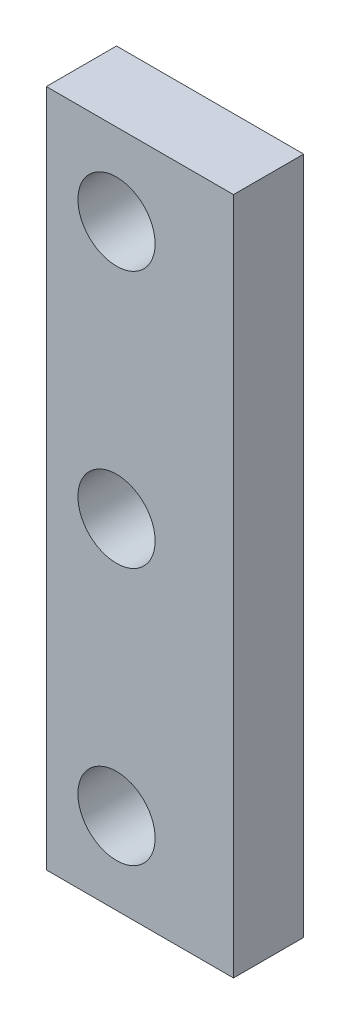
ISO-10303-21;
HEADER;
FILE_DESCRIPTION(('STEP AP214'),'2;1');
FILE_NAME('part.step','',(''),(''),'','','');
FILE_SCHEMA(('AUTOMOTIVE_DESIGN { 1 0 10303 214 1 1 1 1 }'));
ENDSEC;
DATA;
#1=APPLICATION_CONTEXT('core data for automotive mechanical design processes');
#2=APPLICATION_PROTOCOL_DEFINITION('international standard','automotive_design',2000,#1);
#3=PRODUCT_CONTEXT('',#1,'mechanical');
#4=PRODUCT('Part','Part','',(#3));
#5=PRODUCT_RELATED_PRODUCT_CATEGORY('part','',(#4));
#6=PRODUCT_DEFINITION_FORMATION('','',#4);
#7=PRODUCT_DEFINITION_CONTEXT('part definition',#1,'design');
#8=PRODUCT_DEFINITION('design','',#6,#7);
#9=PRODUCT_DEFINITION_SHAPE('','',#8);
#10=(LENGTH_UNIT() NAMED_UNIT(*) SI_UNIT(.MILLI.,.METRE.));
#11=(NAMED_UNIT(*) PLANE_ANGLE_UNIT() SI_UNIT($,.RADIAN.));
#12=(NAMED_UNIT(*) SI_UNIT($,.STERADIAN.) SOLID_ANGLE_UNIT());
#13=UNCERTAINTY_MEASURE_WITH_UNIT(LENGTH_MEASURE(1.E-05),#10,'distance_accuracy_value','');
#14=(GEOMETRIC_REPRESENTATION_CONTEXT(3) GLOBAL_UNCERTAINTY_ASSIGNED_CONTEXT((#13)) GLOBAL_UNIT_ASSIGNED_CONTEXT((#10,
#11,#12)) REPRESENTATION_CONTEXT('',''));
#15=CARTESIAN_POINT('',(0.,0.,0.));
#16=DIRECTION('',(0.,0.,1.));
#17=DIRECTION('',(1.,0.,0.));
#18=AXIS2_PLACEMENT_3D('',#15,#16,#17);
#19=CARTESIAN_POINT('',(0.,0.,3.));
#20=DIRECTION('',(0.,0.,1.));
#21=DIRECTION('',(1.,0.,0.));
#22=AXIS2_PLACEMENT_3D('',#19,#20,#21);
#23=PLANE('',#22);
#24=CARTESIAN_POINT('',(3.,0.,3.));
#25=DIRECTION('',(0.,0.,1.));
#26=DIRECTION('',(1.,0.,0.));
#27=AXIS2_PLACEMENT_3D('',#24,#25,#26);
#28=CIRCLE('',#27,1.65);
#29=CARTESIAN_POINT('',(4.65,0.,3.));
#30=VERTEX_POINT('',#29);
#31=EDGE_CURVE('E114',#30,#30,#28,.T.);
#32=ORIENTED_EDGE('',*,*,#31,.F.);
#33=EDGE_LOOP('',(#32));
#34=FACE_BOUND('',#33,.T.);
#35=DIRECTION('',(0.,1.,0.));
#36=VECTOR('',#35,1.);
#37=CARTESIAN_POINT('',(8.,14.5,3.));
#38=LINE('',#37,#36);
#39=CARTESIAN_POINT('',(8.,-14.5,3.));
#40=VERTEX_POINT('',#39);
#41=CARTESIAN_POINT('',(8.,14.5,3.));
#42=VERTEX_POINT('',#41);
#43=EDGE_CURVE('E84',#40,#42,#38,.T.);
#44=ORIENTED_EDGE('',*,*,#43,.T.);
#45=DIRECTION('',(-1.,0.,0.));
#46=VECTOR('',#45,1.);
#47=CARTESIAN_POINT('',(0.,14.5,3.));
#48=LINE('',#47,#46);
#49=CARTESIAN_POINT('',(0.,14.5,3.));
#50=VERTEX_POINT('',#49);
#51=EDGE_CURVE('E79',#42,#50,#48,.T.);
#52=ORIENTED_EDGE('',*,*,#51,.T.);
#53=DIRECTION('',(0.,-1.,0.));
#54=VECTOR('',#53,1.);
#55=CARTESIAN_POINT('',(0.,14.5,3.));
#56=LINE('',#55,#54);
#57=CARTESIAN_POINT('',(0.,-14.5,3.));
#58=VERTEX_POINT('',#57);
#59=EDGE_CURVE('E82',#50,#58,#56,.T.);
#60=ORIENTED_EDGE('',*,*,#59,.T.);
#61=DIRECTION('',(1.,0.,0.));
#62=VECTOR('',#61,1.);
#63=CARTESIAN_POINT('',(0.,-14.5,3.));
#64=LINE('',#63,#62);
#65=EDGE_CURVE('E49',#58,#40,#64,.T.);
#66=ORIENTED_EDGE('',*,*,#65,.T.);
#67=EDGE_LOOP('',(#44,#52,#60,#66));
#68=FACE_BOUND('',#67,.T.);
#69=CARTESIAN_POINT('',(3.,11.,3.));
#70=DIRECTION('',(0.,0.,1.));
#71=DIRECTION('',(1.,0.,0.));
#72=AXIS2_PLACEMENT_3D('',#69,#70,#71);
#73=CIRCLE('',#72,1.65);
#74=CARTESIAN_POINT('',(4.65,11.,3.));
#75=VERTEX_POINT('',#74);
#76=EDGE_CURVE('E99',#75,#75,#73,.T.);
#77=ORIENTED_EDGE('',*,*,#76,.F.);
#78=EDGE_LOOP('',(#77));
#79=FACE_BOUND('',#78,.T.);
#80=CARTESIAN_POINT('',(3.,-11.,3.));
#81=DIRECTION('',(0.,0.,1.));
#82=DIRECTION('',(-1.,0.,0.));
#83=AXIS2_PLACEMENT_3D('',#80,#81,#82);
#84=CIRCLE('',#83,1.65);
#85=CARTESIAN_POINT('',(1.35,-11.,3.));
#86=VERTEX_POINT('',#85);
#87=EDGE_CURVE('E120',#86,#86,#84,.T.);
#88=ORIENTED_EDGE('',*,*,#87,.F.);
#89=EDGE_LOOP('',(#88));
#90=FACE_BOUND('',#89,.T.);
#91=ADVANCED_FACE('F32',(#34,#68,#79,#90),#23,.T.);
#92=CARTESIAN_POINT('',(0.,0.,0.));
#93=DIRECTION('',(0.,0.,1.));
#94=DIRECTION('',(1.,0.,0.));
#95=AXIS2_PLACEMENT_3D('',#92,#93,#94);
#96=PLANE('',#95);
#97=DIRECTION('',(0.,1.,0.));
#98=VECTOR('',#97,1.);
#99=CARTESIAN_POINT('',(8.,14.5,0.));
#100=LINE('',#99,#98);
#101=CARTESIAN_POINT('',(8.,-14.5,0.));
#102=VERTEX_POINT('',#101);
#103=CARTESIAN_POINT('',(8.,14.5,0.));
#104=VERTEX_POINT('',#103);
#105=EDGE_CURVE('E96',#102,#104,#100,.T.);
#106=ORIENTED_EDGE('',*,*,#105,.F.);
#107=DIRECTION('',(1.,0.,0.));
#108=VECTOR('',#107,1.);
#109=CARTESIAN_POINT('',(0.,-14.5,0.));
#110=LINE('',#109,#108);
#111=CARTESIAN_POINT('',(0.,-14.5,0.));
#112=VERTEX_POINT('',#111);
#113=EDGE_CURVE('E72',#112,#102,#110,.T.);
#114=ORIENTED_EDGE('',*,*,#113,.F.);
#115=DIRECTION('',(0.,-1.,0.));
#116=VECTOR('',#115,1.);
#117=CARTESIAN_POINT('',(0.,14.5,0.));
#118=LINE('',#117,#116);
#119=CARTESIAN_POINT('',(0.,14.5,0.));
#120=VERTEX_POINT('',#119);
#121=EDGE_CURVE('E66',#120,#112,#118,.T.);
#122=ORIENTED_EDGE('',*,*,#121,.F.);
#123=DIRECTION('',(-1.,0.,0.));
#124=VECTOR('',#123,1.);
#125=CARTESIAN_POINT('',(0.,14.5,0.));
#126=LINE('',#125,#124);
#127=EDGE_CURVE('E88',#104,#120,#126,.T.);
#128=ORIENTED_EDGE('',*,*,#127,.F.);
#129=EDGE_LOOP('',(#106,#114,#122,#128));
#130=FACE_BOUND('',#129,.T.);
#131=CARTESIAN_POINT('',(3.,11.,0.));
#132=DIRECTION('',(0.,0.,1.));
#133=DIRECTION('',(1.,0.,0.));
#134=AXIS2_PLACEMENT_3D('',#131,#132,#133);
#135=CIRCLE('',#134,1.65);
#136=CARTESIAN_POINT('',(4.65,11.,0.));
#137=VERTEX_POINT('',#136);
#138=EDGE_CURVE('E111',#137,#137,#135,.T.);
#139=ORIENTED_EDGE('',*,*,#138,.T.);
#140=EDGE_LOOP('',(#139));
#141=FACE_BOUND('',#140,.T.);
#142=CARTESIAN_POINT('',(3.,0.,0.));
#143=DIRECTION('',(0.,0.,1.));
#144=DIRECTION('',(1.,0.,0.));
#145=AXIS2_PLACEMENT_3D('',#142,#143,#144);
#146=CIRCLE('',#145,1.65);
#147=CARTESIAN_POINT('',(4.65,0.,0.));
#148=VERTEX_POINT('',#147);
#149=EDGE_CURVE('E117',#148,#148,#146,.T.);
#150=ORIENTED_EDGE('',*,*,#149,.T.);
#151=EDGE_LOOP('',(#150));
#152=FACE_BOUND('',#151,.T.);
#153=CARTESIAN_POINT('',(3.,-11.,0.));
#154=DIRECTION('',(0.,0.,1.));
#155=DIRECTION('',(-1.,0.,0.));
#156=AXIS2_PLACEMENT_3D('',#153,#154,#155);
#157=CIRCLE('',#156,1.65);
#158=CARTESIAN_POINT('',(1.35,-11.,0.));
#159=VERTEX_POINT('',#158);
#160=EDGE_CURVE('E123',#159,#159,#157,.T.);
#161=ORIENTED_EDGE('',*,*,#160,.T.);
#162=EDGE_LOOP('',(#161));
#163=FACE_BOUND('',#162,.T.);
#164=ADVANCED_FACE('F107',(#130,#141,#152,#163),#96,.F.);
#165=CARTESIAN_POINT('',(8.,14.5,3.));
#166=DIRECTION('',(-1.,0.,0.));
#167=DIRECTION('',(0.,0.,1.));
#168=AXIS2_PLACEMENT_3D('',#165,#166,#167);
#169=PLANE('',#168);
#170=ORIENTED_EDGE('',*,*,#105,.T.);
#171=DIRECTION('',(0.,0.,-1.));
#172=VECTOR('',#171,1.);
#173=CARTESIAN_POINT('',(8.,14.5,3.));
#174=LINE('',#173,#172);
#175=EDGE_CURVE('E11',#42,#104,#174,.T.);
#176=ORIENTED_EDGE('',*,*,#175,.F.);
#177=ORIENTED_EDGE('',*,*,#43,.F.);
#178=DIRECTION('',(0.,0.,-1.));
#179=VECTOR('',#178,1.);
#180=CARTESIAN_POINT('',(8.,-14.5,3.));
#181=LINE('',#180,#179);
#182=EDGE_CURVE('E92',#40,#102,#181,.T.);
#183=ORIENTED_EDGE('',*,*,#182,.T.);
#184=EDGE_LOOP('',(#170,#176,#177,#183));
#185=FACE_BOUND('',#184,.T.);
#186=ADVANCED_FACE('F34',(#185),#169,.F.);
#187=CARTESIAN_POINT('',(0.,14.5,3.));
#188=DIRECTION('',(0.,-1.,0.));
#189=DIRECTION('',(0.,0.,-1.));
#190=AXIS2_PLACEMENT_3D('',#187,#188,#189);
#191=PLANE('',#190);
#192=ORIENTED_EDGE('',*,*,#127,.T.);
#193=DIRECTION('',(0.,0.,-1.));
#194=VECTOR('',#193,1.);
#195=CARTESIAN_POINT('',(0.,14.5,3.));
#196=LINE('',#195,#194);
#197=EDGE_CURVE('E41',#50,#120,#196,.T.);
#198=ORIENTED_EDGE('',*,*,#197,.F.);
#199=ORIENTED_EDGE('',*,*,#51,.F.);
#200=ORIENTED_EDGE('',*,*,#175,.T.);
#201=EDGE_LOOP('',(#192,#198,#199,#200));
#202=FACE_BOUND('',#201,.T.);
#203=ADVANCED_FACE('F87',(#202),#191,.F.);
#204=CARTESIAN_POINT('',(0.,14.5,3.));
#205=DIRECTION('',(1.,0.,0.));
#206=DIRECTION('',(0.,0.,-1.));
#207=AXIS2_PLACEMENT_3D('',#204,#205,#206);
#208=PLANE('',#207);
#209=ORIENTED_EDGE('',*,*,#121,.T.);
#210=DIRECTION('',(0.,0.,-1.));
#211=VECTOR('',#210,1.);
#212=CARTESIAN_POINT('',(0.,-14.5,3.));
#213=LINE('',#212,#211);
#214=EDGE_CURVE('E89',#58,#112,#213,.T.);
#215=ORIENTED_EDGE('',*,*,#214,.F.);
#216=ORIENTED_EDGE('',*,*,#59,.F.);
#217=ORIENTED_EDGE('',*,*,#197,.T.);
#218=EDGE_LOOP('',(#209,#215,#216,#217));
#219=FACE_BOUND('',#218,.T.);
#220=ADVANCED_FACE('F90',(#219),#208,.F.);
#221=CARTESIAN_POINT('',(0.,-14.5,3.));
#222=DIRECTION('',(0.,1.,0.));
#223=DIRECTION('',(0.,0.,1.));
#224=AXIS2_PLACEMENT_3D('',#221,#222,#223);
#225=PLANE('',#224);
#226=ORIENTED_EDGE('',*,*,#113,.T.);
#227=ORIENTED_EDGE('',*,*,#182,.F.);
#228=ORIENTED_EDGE('',*,*,#65,.F.);
#229=ORIENTED_EDGE('',*,*,#214,.T.);
#230=EDGE_LOOP('',(#226,#227,#228,#229));
#231=FACE_BOUND('',#230,.T.);
#232=ADVANCED_FACE('F104',(#231),#225,.F.);
#233=CARTESIAN_POINT('',(3.,11.,3.));
#234=DIRECTION('',(0.,0.,-1.));
#235=DIRECTION('',(-1.,0.,0.));
#236=AXIS2_PLACEMENT_3D('',#233,#234,#235);
#237=CYLINDRICAL_SURFACE('',#236,1.65);
#238=ORIENTED_EDGE('',*,*,#76,.T.);
#239=EDGE_LOOP('',(#238));
#240=FACE_BOUND('',#239,.T.);
#241=ORIENTED_EDGE('',*,*,#138,.F.);
#242=EDGE_LOOP('',(#241));
#243=FACE_BOUND('',#242,.T.);
#244=ADVANCED_FACE('F141',(#240,#243),#237,.F.);
#245=CARTESIAN_POINT('',(3.,0.,3.));
#246=DIRECTION('',(0.,0.,-1.));
#247=DIRECTION('',(-1.,0.,0.));
#248=AXIS2_PLACEMENT_3D('',#245,#246,#247);
#249=CYLINDRICAL_SURFACE('',#248,1.65);
#250=ORIENTED_EDGE('',*,*,#31,.T.);
#251=EDGE_LOOP('',(#250));
#252=FACE_BOUND('',#251,.T.);
#253=ORIENTED_EDGE('',*,*,#149,.F.);
#254=EDGE_LOOP('',(#253));
#255=FACE_BOUND('',#254,.T.);
#256=ADVANCED_FACE('F187',(#252,#255),#249,.F.);
#257=CARTESIAN_POINT('',(3.,-11.,3.));
#258=DIRECTION('',(0.,0.,-1.));
#259=DIRECTION('',(-1.,0.,0.));
#260=AXIS2_PLACEMENT_3D('',#257,#258,#259);
#261=CYLINDRICAL_SURFACE('',#260,1.65);
#262=ORIENTED_EDGE('',*,*,#87,.T.);
#263=EDGE_LOOP('',(#262));
#264=FACE_BOUND('',#263,.T.);
#265=ORIENTED_EDGE('',*,*,#160,.F.);
#266=EDGE_LOOP('',(#265));
#267=FACE_BOUND('',#266,.T.);
#268=ADVANCED_FACE('F129',(#264,#267),#261,.F.);
#269=CLOSED_SHELL('',(#91,#164,#186,#203,#220,#232,#244,#256,#268));
#270=MANIFOLD_SOLID_BREP('B2',#269);
#271=ADVANCED_BREP_SHAPE_REPRESENTATION('',(#18,#270),#14);
#272=SHAPE_DEFINITION_REPRESENTATION(#9,#271);
ENDSEC;
END-ISO-10303-21;
